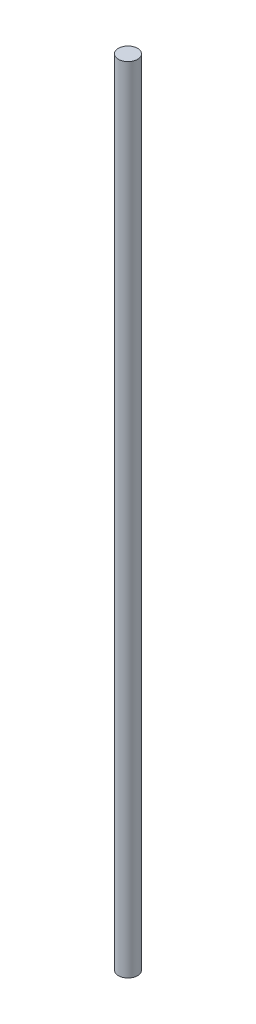
ISO-10303-21;
HEADER;
FILE_DESCRIPTION(('STEP AP214'),'2;1');
FILE_NAME('part.step','',(''),(''),'','','');
FILE_SCHEMA(('AUTOMOTIVE_DESIGN { 1 0 10303 214 1 1 1 1 }'));
ENDSEC;
DATA;
#1=APPLICATION_CONTEXT('core data for automotive mechanical design processes');
#2=APPLICATION_PROTOCOL_DEFINITION('international standard','automotive_design',2000,#1);
#3=PRODUCT_CONTEXT('',#1,'mechanical');
#4=PRODUCT('Part','Part','',(#3));
#5=PRODUCT_RELATED_PRODUCT_CATEGORY('part','',(#4));
#6=PRODUCT_DEFINITION_FORMATION('','',#4);
#7=PRODUCT_DEFINITION_CONTEXT('part definition',#1,'design');
#8=PRODUCT_DEFINITION('design','',#6,#7);
#9=PRODUCT_DEFINITION_SHAPE('','',#8);
#10=(LENGTH_UNIT() NAMED_UNIT(*) SI_UNIT(.MILLI.,.METRE.));
#11=(NAMED_UNIT(*) PLANE_ANGLE_UNIT() SI_UNIT($,.RADIAN.));
#12=(NAMED_UNIT(*) SI_UNIT($,.STERADIAN.) SOLID_ANGLE_UNIT());
#13=UNCERTAINTY_MEASURE_WITH_UNIT(LENGTH_MEASURE(1.E-05),#10,'distance_accuracy_value','');
#14=(GEOMETRIC_REPRESENTATION_CONTEXT(3) GLOBAL_UNCERTAINTY_ASSIGNED_CONTEXT((#13)) GLOBAL_UNIT_ASSIGNED_CONTEXT((#10,
#11,#12)) REPRESENTATION_CONTEXT('',''));
#15=CARTESIAN_POINT('',(0.,0.,0.));
#16=DIRECTION('',(0.,0.,1.));
#17=DIRECTION('',(1.,0.,0.));
#18=AXIS2_PLACEMENT_3D('',#15,#16,#17);
#19=CARTESIAN_POINT('',(0.,282.,0.));
#20=DIRECTION('',(0.,-1.,0.));
#21=DIRECTION('',(0.,0.,-1.));
#22=AXIS2_PLACEMENT_3D('',#19,#20,#21);
#23=CYLINDRICAL_SURFACE('',#22,3.4);
#24=CARTESIAN_POINT('',(0.,282.,0.));
#25=DIRECTION('',(0.,1.,0.));
#26=DIRECTION('',(0.,0.,1.));
#27=AXIS2_PLACEMENT_3D('',#24,#25,#26);
#28=CIRCLE('',#27,3.4);
#29=CARTESIAN_POINT('',(0.,282.,3.4));
#30=VERTEX_POINT('',#29);
#31=EDGE_CURVE('E10',#30,#30,#28,.T.);
#32=ORIENTED_EDGE('',*,*,#31,.F.);
#33=EDGE_LOOP('',(#32));
#34=FACE_BOUND('',#33,.T.);
#35=CARTESIAN_POINT('',(0.,0.,0.));
#36=DIRECTION('',(0.,1.,0.));
#37=DIRECTION('',(0.,0.,1.));
#38=AXIS2_PLACEMENT_3D('',#35,#36,#37);
#39=CIRCLE('',#38,3.4);
#40=CARTESIAN_POINT('',(0.,0.,3.4));
#41=VERTEX_POINT('',#40);
#42=EDGE_CURVE('E34',#41,#41,#39,.T.);
#43=ORIENTED_EDGE('',*,*,#42,.T.);
#44=EDGE_LOOP('',(#43));
#45=FACE_BOUND('',#44,.T.);
#46=ADVANCED_FACE('F31',(#34,#45),#23,.T.);
#47=CARTESIAN_POINT('',(0.,282.,0.));
#48=DIRECTION('',(0.,1.,0.));
#49=DIRECTION('',(0.,0.,1.));
#50=AXIS2_PLACEMENT_3D('',#47,#48,#49);
#51=PLANE('',#50);
#52=ORIENTED_EDGE('',*,*,#31,.T.);
#53=EDGE_LOOP('',(#52));
#54=FACE_BOUND('',#53,.T.);
#55=ADVANCED_FACE('F46',(#54),#51,.T.);
#56=CARTESIAN_POINT('',(0.,0.,0.));
#57=DIRECTION('',(0.,1.,0.));
#58=DIRECTION('',(0.,0.,1.));
#59=AXIS2_PLACEMENT_3D('',#56,#57,#58);
#60=PLANE('',#59);
#61=ORIENTED_EDGE('',*,*,#42,.F.);
#62=EDGE_LOOP('',(#61));
#63=FACE_BOUND('',#62,.T.);
#64=ADVANCED_FACE('F44',(#63),#60,.F.);
#65=CLOSED_SHELL('',(#46,#55,#64));
#66=MANIFOLD_SOLID_BREP('B2',#65);
#67=ADVANCED_BREP_SHAPE_REPRESENTATION('',(#18,#66),#14);
#68=SHAPE_DEFINITION_REPRESENTATION(#9,#67);
ENDSEC;
END-ISO-10303-21;
